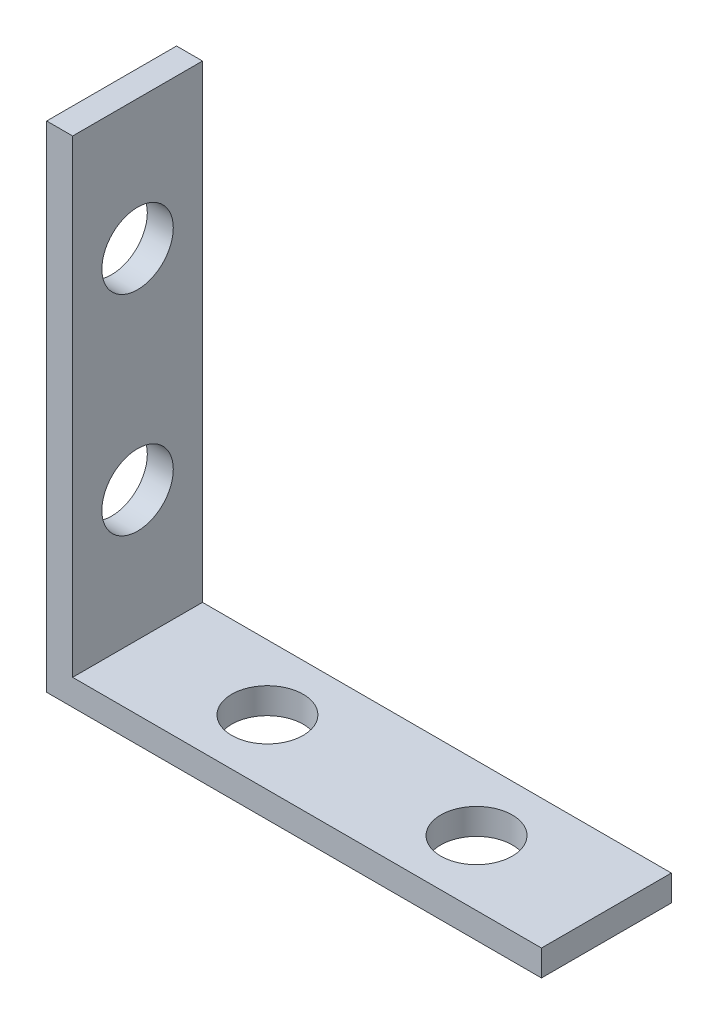
ISO-10303-21;
HEADER;
FILE_DESCRIPTION(('STEP AP214'),'2;1');
FILE_NAME('part.step','',(''),(''),'','','');
FILE_SCHEMA(('AUTOMOTIVE_DESIGN { 1 0 10303 214 1 1 1 1 }'));
ENDSEC;
DATA;
#1=APPLICATION_CONTEXT('core data for automotive mechanical design processes');
#2=APPLICATION_PROTOCOL_DEFINITION('international standard','automotive_design',2000,#1);
#3=PRODUCT_CONTEXT('',#1,'mechanical');
#4=PRODUCT('Part','Part','',(#3));
#5=PRODUCT_RELATED_PRODUCT_CATEGORY('part','',(#4));
#6=PRODUCT_DEFINITION_FORMATION('','',#4);
#7=PRODUCT_DEFINITION_CONTEXT('part definition',#1,'design');
#8=PRODUCT_DEFINITION('design','',#6,#7);
#9=PRODUCT_DEFINITION_SHAPE('','',#8);
#10=(LENGTH_UNIT() NAMED_UNIT(*) SI_UNIT(.MILLI.,.METRE.));
#11=(NAMED_UNIT(*) PLANE_ANGLE_UNIT() SI_UNIT($,.RADIAN.));
#12=(NAMED_UNIT(*) SI_UNIT($,.STERADIAN.) SOLID_ANGLE_UNIT());
#13=UNCERTAINTY_MEASURE_WITH_UNIT(LENGTH_MEASURE(1.E-05),#10,'distance_accuracy_value','');
#14=(GEOMETRIC_REPRESENTATION_CONTEXT(3) GLOBAL_UNCERTAINTY_ASSIGNED_CONTEXT((#13)) GLOBAL_UNIT_ASSIGNED_CONTEXT((#10,
#11,#12)) REPRESENTATION_CONTEXT('',''));
#15=CARTESIAN_POINT('',(0.,0.,0.));
#16=DIRECTION('',(0.,0.,1.));
#17=DIRECTION('',(1.,0.,0.));
#18=AXIS2_PLACEMENT_3D('',#15,#16,#17);
#19=CARTESIAN_POINT('',(0.,38.1,10.));
#20=DIRECTION('',(1.,0.,0.));
#21=DIRECTION('',(0.,1.,0.));
#22=AXIS2_PLACEMENT_3D('',#19,#20,#21);
#23=PLANE('',#22);
#24=CARTESIAN_POINT('',(0.,12.,5.));
#25=DIRECTION('',(1.,0.,0.));
#26=DIRECTION('',(0.,0.,-1.));
#27=AXIS2_PLACEMENT_3D('',#24,#25,#26);
#28=CIRCLE('',#27,2.74999999999999);
#29=CARTESIAN_POINT('',(0.,12.,2.25000000000001));
#30=VERTEX_POINT('',#29);
#31=EDGE_CURVE('E182',#30,#30,#28,.T.);
#32=ORIENTED_EDGE('',*,*,#31,.T.);
#33=EDGE_LOOP('',(#32));
#34=FACE_BOUND('',#33,.T.);
#35=CARTESIAN_POINT('',(0.,28.1,5.));
#36=DIRECTION('',(1.,0.,0.));
#37=DIRECTION('',(0.,0.,-1.));
#38=AXIS2_PLACEMENT_3D('',#35,#36,#37);
#39=CIRCLE('',#38,2.74999999999999);
#40=CARTESIAN_POINT('',(0.,28.1,2.25000000000001));
#41=VERTEX_POINT('',#40);
#42=EDGE_CURVE('E185',#41,#41,#39,.T.);
#43=ORIENTED_EDGE('',*,*,#42,.T.);
#44=EDGE_LOOP('',(#43));
#45=FACE_BOUND('',#44,.T.);
#46=DIRECTION('',(0.,-1.,0.));
#47=VECTOR('',#46,1.);
#48=CARTESIAN_POINT('',(0.,38.1,0.));
#49=LINE('',#48,#47);
#50=CARTESIAN_POINT('',(0.,38.1,0.));
#51=VERTEX_POINT('',#50);
#52=CARTESIAN_POINT('',(0.,0.,0.));
#53=VERTEX_POINT('',#52);
#54=EDGE_CURVE('E127',#51,#53,#49,.T.);
#55=ORIENTED_EDGE('',*,*,#54,.T.);
#56=DIRECTION('',(0.,0.,-1.));
#57=VECTOR('',#56,1.);
#58=CARTESIAN_POINT('',(0.,0.,10.));
#59=LINE('',#58,#57);
#60=CARTESIAN_POINT('',(0.,0.,10.));
#61=VERTEX_POINT('',#60);
#62=EDGE_CURVE('E11',#61,#53,#59,.T.);
#63=ORIENTED_EDGE('',*,*,#62,.F.);
#64=DIRECTION('',(0.,-1.,0.));
#65=VECTOR('',#64,1.);
#66=CARTESIAN_POINT('',(0.,38.1,10.));
#67=LINE('',#66,#65);
#68=CARTESIAN_POINT('',(0.,38.1,10.));
#69=VERTEX_POINT('',#68);
#70=EDGE_CURVE('E144',#69,#61,#67,.T.);
#71=ORIENTED_EDGE('',*,*,#70,.F.);
#72=DIRECTION('',(0.,0.,-1.));
#73=VECTOR('',#72,1.);
#74=CARTESIAN_POINT('',(0.,38.1,10.));
#75=LINE('',#74,#73);
#76=EDGE_CURVE('E123',#69,#51,#75,.T.);
#77=ORIENTED_EDGE('',*,*,#76,.T.);
#78=EDGE_LOOP('',(#55,#63,#71,#77));
#79=FACE_BOUND('',#78,.T.);
#80=ADVANCED_FACE('F38',(#34,#45,#79),#23,.F.);
#81=CARTESIAN_POINT('',(0.,0.,10.));
#82=DIRECTION('',(0.,1.,0.));
#83=DIRECTION('',(0.,0.,1.));
#84=AXIS2_PLACEMENT_3D('',#81,#82,#83);
#85=PLANE('',#84);
#86=CARTESIAN_POINT('',(12.,0.,5.));
#87=DIRECTION('',(0.,1.,0.));
#88=DIRECTION('',(0.,0.,1.));
#89=AXIS2_PLACEMENT_3D('',#86,#87,#88);
#90=CIRCLE('',#89,2.74999999999999);
#91=CARTESIAN_POINT('',(12.,0.,7.74999999999999));
#92=VERTEX_POINT('',#91);
#93=EDGE_CURVE('E194',#92,#92,#90,.T.);
#94=ORIENTED_EDGE('',*,*,#93,.T.);
#95=EDGE_LOOP('',(#94));
#96=FACE_BOUND('',#95,.T.);
#97=CARTESIAN_POINT('',(28.1,0.,5.));
#98=DIRECTION('',(0.,1.,0.));
#99=DIRECTION('',(0.,0.,1.));
#100=AXIS2_PLACEMENT_3D('',#97,#98,#99);
#101=CIRCLE('',#100,2.74999999999999);
#102=CARTESIAN_POINT('',(28.1,0.,7.74999999999999));
#103=VERTEX_POINT('',#102);
#104=EDGE_CURVE('E132',#103,#103,#101,.T.);
#105=ORIENTED_EDGE('',*,*,#104,.T.);
#106=EDGE_LOOP('',(#105));
#107=FACE_BOUND('',#106,.T.);
#108=DIRECTION('',(1.,0.,0.));
#109=VECTOR('',#108,1.);
#110=CARTESIAN_POINT('',(0.,0.,0.));
#111=LINE('',#110,#109);
#112=CARTESIAN_POINT('',(38.1,0.,0.));
#113=VERTEX_POINT('',#112);
#114=EDGE_CURVE('E131',#53,#113,#111,.T.);
#115=ORIENTED_EDGE('',*,*,#114,.T.);
#116=DIRECTION('',(0.,0.,-1.));
#117=VECTOR('',#116,1.);
#118=CARTESIAN_POINT('',(38.1,0.,10.));
#119=LINE('',#118,#117);
#120=CARTESIAN_POINT('',(38.1,0.,10.));
#121=VERTEX_POINT('',#120);
#122=EDGE_CURVE('E47',#121,#113,#119,.T.);
#123=ORIENTED_EDGE('',*,*,#122,.F.);
#124=DIRECTION('',(1.,0.,0.));
#125=VECTOR('',#124,1.);
#126=CARTESIAN_POINT('',(0.,0.,10.));
#127=LINE('',#126,#125);
#128=EDGE_CURVE('E92',#61,#121,#127,.T.);
#129=ORIENTED_EDGE('',*,*,#128,.F.);
#130=ORIENTED_EDGE('',*,*,#62,.T.);
#131=EDGE_LOOP('',(#115,#123,#129,#130));
#132=FACE_BOUND('',#131,.T.);
#133=ADVANCED_FACE('F173',(#96,#107,#132),#85,.F.);
#134=CARTESIAN_POINT('',(38.1,0.,10.));
#135=DIRECTION('',(-1.,0.,0.));
#136=DIRECTION('',(0.,0.,1.));
#137=AXIS2_PLACEMENT_3D('',#134,#135,#136);
#138=PLANE('',#137);
#139=DIRECTION('',(0.,1.,0.));
#140=VECTOR('',#139,1.);
#141=CARTESIAN_POINT('',(38.1,0.,0.));
#142=LINE('',#141,#140);
#143=CARTESIAN_POINT('',(38.1,2.,0.));
#144=VERTEX_POINT('',#143);
#145=EDGE_CURVE('E135',#113,#144,#142,.T.);
#146=ORIENTED_EDGE('',*,*,#145,.T.);
#147=DIRECTION('',(0.,0.,-1.));
#148=VECTOR('',#147,1.);
#149=CARTESIAN_POINT('',(38.1,2.,10.));
#150=LINE('',#149,#148);
#151=CARTESIAN_POINT('',(38.1,2.,10.));
#152=VERTEX_POINT('',#151);
#153=EDGE_CURVE('E116',#152,#144,#150,.T.);
#154=ORIENTED_EDGE('',*,*,#153,.F.);
#155=DIRECTION('',(0.,1.,0.));
#156=VECTOR('',#155,1.);
#157=CARTESIAN_POINT('',(38.1,0.,10.));
#158=LINE('',#157,#156);
#159=EDGE_CURVE('E105',#121,#152,#158,.T.);
#160=ORIENTED_EDGE('',*,*,#159,.F.);
#161=ORIENTED_EDGE('',*,*,#122,.T.);
#162=EDGE_LOOP('',(#146,#154,#160,#161));
#163=FACE_BOUND('',#162,.T.);
#164=ADVANCED_FACE('F154',(#163),#138,.F.);
#165=CARTESIAN_POINT('',(38.1,2.,10.));
#166=DIRECTION('',(0.,-1.,0.));
#167=DIRECTION('',(1.,0.,0.));
#168=AXIS2_PLACEMENT_3D('',#165,#166,#167);
#169=PLANE('',#168);
#170=CARTESIAN_POINT('',(12.,2.,5.));
#171=DIRECTION('',(0.,1.,0.));
#172=DIRECTION('',(0.,0.,1.));
#173=AXIS2_PLACEMENT_3D('',#170,#171,#172);
#174=CIRCLE('',#173,2.74999999999999);
#175=CARTESIAN_POINT('',(12.,2.,7.74999999999999));
#176=VERTEX_POINT('',#175);
#177=EDGE_CURVE('E188',#176,#176,#174,.T.);
#178=ORIENTED_EDGE('',*,*,#177,.F.);
#179=EDGE_LOOP('',(#178));
#180=FACE_BOUND('',#179,.T.);
#181=CARTESIAN_POINT('',(28.1,2.,5.));
#182=DIRECTION('',(0.,1.,0.));
#183=DIRECTION('',(0.,0.,1.));
#184=AXIS2_PLACEMENT_3D('',#181,#182,#183);
#185=CIRCLE('',#184,2.74999999999999);
#186=CARTESIAN_POINT('',(28.1,2.,7.74999999999999));
#187=VERTEX_POINT('',#186);
#188=EDGE_CURVE('E203',#187,#187,#185,.T.);
#189=ORIENTED_EDGE('',*,*,#188,.F.);
#190=EDGE_LOOP('',(#189));
#191=FACE_BOUND('',#190,.T.);
#192=DIRECTION('',(-1.,0.,0.));
#193=VECTOR('',#192,1.);
#194=CARTESIAN_POINT('',(38.1,2.,0.));
#195=LINE('',#194,#193);
#196=CARTESIAN_POINT('',(2.,2.,0.));
#197=VERTEX_POINT('',#196);
#198=EDGE_CURVE('E114',#144,#197,#195,.T.);
#199=ORIENTED_EDGE('',*,*,#198,.T.);
#200=DIRECTION('',(0.,0.,-1.));
#201=VECTOR('',#200,1.);
#202=CARTESIAN_POINT('',(2.,2.,10.));
#203=LINE('',#202,#201);
#204=CARTESIAN_POINT('',(2.,2.,10.));
#205=VERTEX_POINT('',#204);
#206=EDGE_CURVE('E111',#205,#197,#203,.T.);
#207=ORIENTED_EDGE('',*,*,#206,.F.);
#208=DIRECTION('',(-1.,0.,0.));
#209=VECTOR('',#208,1.);
#210=CARTESIAN_POINT('',(38.1,2.,10.));
#211=LINE('',#210,#209);
#212=EDGE_CURVE('E99',#152,#205,#211,.T.);
#213=ORIENTED_EDGE('',*,*,#212,.F.);
#214=ORIENTED_EDGE('',*,*,#153,.T.);
#215=EDGE_LOOP('',(#199,#207,#213,#214));
#216=FACE_BOUND('',#215,.T.);
#217=ADVANCED_FACE('F112',(#180,#191,#216),#169,.F.);
#218=CARTESIAN_POINT('',(2.,2.,10.));
#219=DIRECTION('',(-1.,0.,0.));
#220=DIRECTION('',(0.,-1.,0.));
#221=AXIS2_PLACEMENT_3D('',#218,#219,#220);
#222=PLANE('',#221);
#223=CARTESIAN_POINT('',(2.,12.,5.));
#224=DIRECTION('',(1.,0.,0.));
#225=DIRECTION('',(0.,0.,-1.));
#226=AXIS2_PLACEMENT_3D('',#223,#224,#225);
#227=CIRCLE('',#226,2.74999999999999);
#228=CARTESIAN_POINT('',(2.,12.,2.25000000000001));
#229=VERTEX_POINT('',#228);
#230=EDGE_CURVE('E281',#229,#229,#227,.T.);
#231=ORIENTED_EDGE('',*,*,#230,.F.);
#232=EDGE_LOOP('',(#231));
#233=FACE_BOUND('',#232,.T.);
#234=CARTESIAN_POINT('',(2.,28.1,5.));
#235=DIRECTION('',(1.,0.,0.));
#236=DIRECTION('',(0.,0.,-1.));
#237=AXIS2_PLACEMENT_3D('',#234,#235,#236);
#238=CIRCLE('',#237,2.74999999999999);
#239=CARTESIAN_POINT('',(2.,28.1,2.25000000000001));
#240=VERTEX_POINT('',#239);
#241=EDGE_CURVE('E189',#240,#240,#238,.T.);
#242=ORIENTED_EDGE('',*,*,#241,.F.);
#243=EDGE_LOOP('',(#242));
#244=FACE_BOUND('',#243,.T.);
#245=DIRECTION('',(0.,1.,0.));
#246=VECTOR('',#245,1.);
#247=CARTESIAN_POINT('',(2.,2.,0.));
#248=LINE('',#247,#246);
#249=CARTESIAN_POINT('',(2.,38.1,0.));
#250=VERTEX_POINT('',#249);
#251=EDGE_CURVE('E78',#197,#250,#248,.T.);
#252=ORIENTED_EDGE('',*,*,#251,.T.);
#253=DIRECTION('',(0.,0.,-1.));
#254=VECTOR('',#253,1.);
#255=CARTESIAN_POINT('',(2.,38.1,10.));
#256=LINE('',#255,#254);
#257=CARTESIAN_POINT('',(2.,38.1,10.));
#258=VERTEX_POINT('',#257);
#259=EDGE_CURVE('E117',#258,#250,#256,.T.);
#260=ORIENTED_EDGE('',*,*,#259,.F.);
#261=DIRECTION('',(0.,1.,0.));
#262=VECTOR('',#261,1.);
#263=CARTESIAN_POINT('',(2.,2.,10.));
#264=LINE('',#263,#262);
#265=EDGE_CURVE('E103',#205,#258,#264,.T.);
#266=ORIENTED_EDGE('',*,*,#265,.F.);
#267=ORIENTED_EDGE('',*,*,#206,.T.);
#268=EDGE_LOOP('',(#252,#260,#266,#267));
#269=FACE_BOUND('',#268,.T.);
#270=ADVANCED_FACE('F119',(#233,#244,#269),#222,.F.);
#271=CARTESIAN_POINT('',(2.,38.1,10.));
#272=DIRECTION('',(0.,-1.,0.));
#273=DIRECTION('',(0.,0.,-1.));
#274=AXIS2_PLACEMENT_3D('',#271,#272,#273);
#275=PLANE('',#274);
#276=DIRECTION('',(-1.,0.,0.));
#277=VECTOR('',#276,1.);
#278=CARTESIAN_POINT('',(2.,38.1,0.));
#279=LINE('',#278,#277);
#280=EDGE_CURVE('E84',#250,#51,#279,.T.);
#281=ORIENTED_EDGE('',*,*,#280,.T.);
#282=ORIENTED_EDGE('',*,*,#76,.F.);
#283=DIRECTION('',(-1.,0.,0.));
#284=VECTOR('',#283,1.);
#285=CARTESIAN_POINT('',(2.,38.1,10.));
#286=LINE('',#285,#284);
#287=EDGE_CURVE('E55',#258,#69,#286,.T.);
#288=ORIENTED_EDGE('',*,*,#287,.F.);
#289=ORIENTED_EDGE('',*,*,#259,.T.);
#290=EDGE_LOOP('',(#281,#282,#288,#289));
#291=FACE_BOUND('',#290,.T.);
#292=ADVANCED_FACE('F161',(#291),#275,.F.);
#293=CARTESIAN_POINT('',(0.,0.,10.));
#294=DIRECTION('',(0.,0.,1.));
#295=DIRECTION('',(1.,0.,0.));
#296=AXIS2_PLACEMENT_3D('',#293,#294,#295);
#297=PLANE('',#296);
#298=ORIENTED_EDGE('',*,*,#70,.T.);
#299=ORIENTED_EDGE('',*,*,#128,.T.);
#300=ORIENTED_EDGE('',*,*,#159,.T.);
#301=ORIENTED_EDGE('',*,*,#212,.T.);
#302=ORIENTED_EDGE('',*,*,#265,.T.);
#303=ORIENTED_EDGE('',*,*,#287,.T.);
#304=EDGE_LOOP('',(#298,#299,#300,#301,#302,#303));
#305=FACE_BOUND('',#304,.T.);
#306=ADVANCED_FACE('F101',(#305),#297,.T.);
#307=CARTESIAN_POINT('',(0.,0.,0.));
#308=DIRECTION('',(0.,0.,1.));
#309=DIRECTION('',(1.,0.,0.));
#310=AXIS2_PLACEMENT_3D('',#307,#308,#309);
#311=PLANE('',#310);
#312=ORIENTED_EDGE('',*,*,#54,.F.);
#313=ORIENTED_EDGE('',*,*,#280,.F.);
#314=ORIENTED_EDGE('',*,*,#251,.F.);
#315=ORIENTED_EDGE('',*,*,#198,.F.);
#316=ORIENTED_EDGE('',*,*,#145,.F.);
#317=ORIENTED_EDGE('',*,*,#114,.F.);
#318=EDGE_LOOP('',(#312,#313,#314,#315,#316,#317));
#319=FACE_BOUND('',#318,.T.);
#320=ADVANCED_FACE('F157',(#319),#311,.F.);
#321=CARTESIAN_POINT('',(28.1,2.,5.));
#322=DIRECTION('',(0.,1.,0.));
#323=DIRECTION('',(0.,0.,1.));
#324=AXIS2_PLACEMENT_3D('',#321,#322,#323);
#325=CYLINDRICAL_SURFACE('',#324,2.74999999999999);
#326=ORIENTED_EDGE('',*,*,#104,.F.);
#327=EDGE_LOOP('',(#326));
#328=FACE_BOUND('',#327,.T.);
#329=ORIENTED_EDGE('',*,*,#188,.T.);
#330=EDGE_LOOP('',(#329));
#331=FACE_BOUND('',#330,.T.);
#332=ADVANCED_FACE('F217',(#328,#331),#325,.F.);
#333=CARTESIAN_POINT('',(12.,2.,5.));
#334=DIRECTION('',(0.,1.,0.));
#335=DIRECTION('',(0.,0.,1.));
#336=AXIS2_PLACEMENT_3D('',#333,#334,#335);
#337=CYLINDRICAL_SURFACE('',#336,2.74999999999999);
#338=ORIENTED_EDGE('',*,*,#93,.F.);
#339=EDGE_LOOP('',(#338));
#340=FACE_BOUND('',#339,.T.);
#341=ORIENTED_EDGE('',*,*,#177,.T.);
#342=EDGE_LOOP('',(#341));
#343=FACE_BOUND('',#342,.T.);
#344=ADVANCED_FACE('F220',(#340,#343),#337,.F.);
#345=CARTESIAN_POINT('',(2.,28.1,5.));
#346=DIRECTION('',(1.,0.,0.));
#347=DIRECTION('',(0.,0.,-1.));
#348=AXIS2_PLACEMENT_3D('',#345,#346,#347);
#349=CYLINDRICAL_SURFACE('',#348,2.74999999999999);
#350=ORIENTED_EDGE('',*,*,#42,.F.);
#351=EDGE_LOOP('',(#350));
#352=FACE_BOUND('',#351,.T.);
#353=ORIENTED_EDGE('',*,*,#241,.T.);
#354=EDGE_LOOP('',(#353));
#355=FACE_BOUND('',#354,.T.);
#356=ADVANCED_FACE('F234',(#352,#355),#349,.F.);
#357=CARTESIAN_POINT('',(2.,12.,5.));
#358=DIRECTION('',(1.,0.,0.));
#359=DIRECTION('',(0.,0.,-1.));
#360=AXIS2_PLACEMENT_3D('',#357,#358,#359);
#361=CYLINDRICAL_SURFACE('',#360,2.74999999999999);
#362=ORIENTED_EDGE('',*,*,#31,.F.);
#363=EDGE_LOOP('',(#362));
#364=FACE_BOUND('',#363,.T.);
#365=ORIENTED_EDGE('',*,*,#230,.T.);
#366=EDGE_LOOP('',(#365));
#367=FACE_BOUND('',#366,.T.);
#368=ADVANCED_FACE('F240',(#364,#367),#361,.F.);
#369=CLOSED_SHELL('',(#80,#133,#164,#217,#270,#292,#306,#320,#332,#344,#356,#368));
#370=MANIFOLD_SOLID_BREP('B2',#369);
#371=ADVANCED_BREP_SHAPE_REPRESENTATION('',(#18,#370),#14);
#372=SHAPE_DEFINITION_REPRESENTATION(#9,#371);
ENDSEC;
END-ISO-10303-21;
